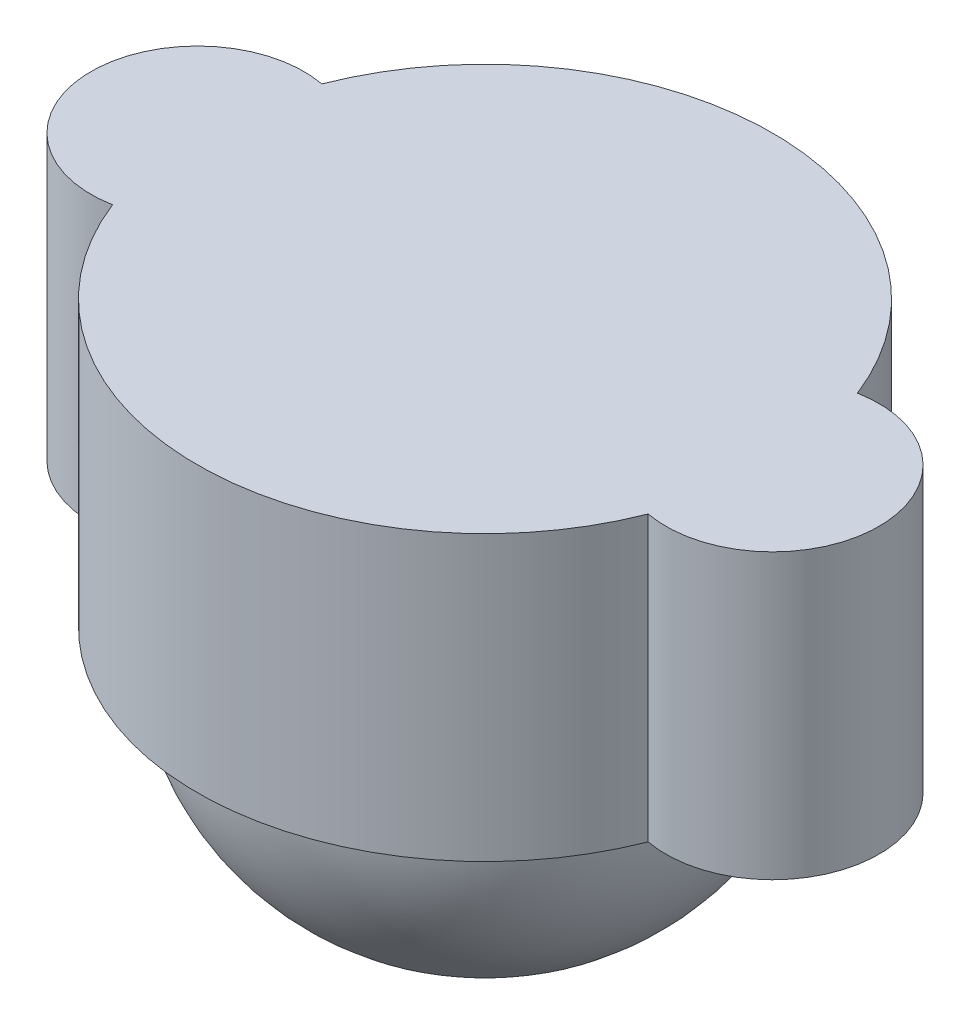
ISO-10303-21;
HEADER;
FILE_DESCRIPTION(('STEP AP214'),'2;1');
FILE_NAME('part.step','',(''),(''),'','','');
FILE_SCHEMA(('AUTOMOTIVE_DESIGN { 1 0 10303 214 1 1 1 1 }'));
ENDSEC;
DATA;
#1=APPLICATION_CONTEXT('core data for automotive mechanical design processes');
#2=APPLICATION_PROTOCOL_DEFINITION('international standard','automotive_design',2000,#1);
#3=PRODUCT_CONTEXT('',#1,'mechanical');
#4=PRODUCT('Part','Part','',(#3));
#5=PRODUCT_RELATED_PRODUCT_CATEGORY('part','',(#4));
#6=PRODUCT_DEFINITION_FORMATION('','',#4);
#7=PRODUCT_DEFINITION_CONTEXT('part definition',#1,'design');
#8=PRODUCT_DEFINITION('design','',#6,#7);
#9=PRODUCT_DEFINITION_SHAPE('','',#8);
#10=(LENGTH_UNIT() NAMED_UNIT(*) SI_UNIT(.MILLI.,.METRE.));
#11=(NAMED_UNIT(*) PLANE_ANGLE_UNIT() SI_UNIT($,.RADIAN.));
#12=(NAMED_UNIT(*) SI_UNIT($,.STERADIAN.) SOLID_ANGLE_UNIT());
#13=UNCERTAINTY_MEASURE_WITH_UNIT(LENGTH_MEASURE(1.E-05),#10,'distance_accuracy_value','');
#14=(GEOMETRIC_REPRESENTATION_CONTEXT(3) GLOBAL_UNCERTAINTY_ASSIGNED_CONTEXT((#13)) GLOBAL_UNIT_ASSIGNED_CONTEXT((#10,
#11,#12)) REPRESENTATION_CONTEXT('',''));
#15=CARTESIAN_POINT('',(0.,0.,0.));
#16=DIRECTION('',(0.,0.,1.));
#17=DIRECTION('',(1.,0.,0.));
#18=AXIS2_PLACEMENT_3D('',#15,#16,#17);
#19=CARTESIAN_POINT('',(0.,-8.,0.));
#20=DIRECTION('',(0.,1.,0.));
#21=DIRECTION('',(0.,0.,1.));
#22=AXIS2_PLACEMENT_3D('',#19,#20,#21);
#23=CYLINDRICAL_SURFACE('',#22,8.1);
#24=CARTESIAN_POINT('',(0.,0.,0.));
#25=DIRECTION('',(0.,1.,0.));
#26=DIRECTION('',(0.,0.,1.));
#27=AXIS2_PLACEMENT_3D('',#24,#25,#26);
#28=CIRCLE('',#27,8.1);
#29=CARTESIAN_POINT('',(7.54444444444444,0.,-2.94811092476036));
#30=VERTEX_POINT('',#29);
#31=CARTESIAN_POINT('',(-7.54444444444444,0.,-2.94811092476036));
#32=VERTEX_POINT('',#31);
#33=EDGE_CURVE('E111',#30,#32,#28,.T.);
#34=ORIENTED_EDGE('',*,*,#33,.F.);
#35=DIRECTION('',(0.,1.,0.));
#36=VECTOR('',#35,1.);
#37=CARTESIAN_POINT('',(7.54444444444444,-8.,-2.94811092476036));
#38=LINE('',#37,#36);
#39=CARTESIAN_POINT('',(7.54444444444444,-8.,-2.94811092476036));
#40=VERTEX_POINT('',#39);
#41=EDGE_CURVE('E11',#40,#30,#38,.T.);
#42=ORIENTED_EDGE('',*,*,#41,.F.);
#43=CARTESIAN_POINT('',(0.,-8.,0.));
#44=DIRECTION('',(0.,1.,0.));
#45=DIRECTION('',(0.,0.,1.));
#46=AXIS2_PLACEMENT_3D('',#43,#44,#45);
#47=CIRCLE('',#46,8.1);
#48=CARTESIAN_POINT('',(-7.54444444444444,-8.,-2.94811092476036));
#49=VERTEX_POINT('',#48);
#50=EDGE_CURVE('E103',#40,#49,#47,.T.);
#51=ORIENTED_EDGE('',*,*,#50,.T.);
#52=DIRECTION('',(0.,1.,0.));
#53=VECTOR('',#52,1.);
#54=CARTESIAN_POINT('',(-7.54444444444444,-8.,-2.94811092476036));
#55=LINE('',#54,#53);
#56=EDGE_CURVE('E83',#49,#32,#55,.T.);
#57=ORIENTED_EDGE('',*,*,#56,.T.);
#58=EDGE_LOOP('',(#34,#42,#51,#57));
#59=FACE_BOUND('',#58,.T.);
#60=ADVANCED_FACE('F39',(#59),#23,.T.);
#61=CARTESIAN_POINT('',(8.1,-8.,0.));
#62=DIRECTION('',(0.,1.,0.));
#63=DIRECTION('',(0.,0.,1.));
#64=AXIS2_PLACEMENT_3D('',#61,#62,#63);
#65=CYLINDRICAL_SURFACE('',#64,3.);
#66=CARTESIAN_POINT('',(8.1,0.,0.));
#67=DIRECTION('',(0.,1.,0.));
#68=DIRECTION('',(0.,0.,1.));
#69=AXIS2_PLACEMENT_3D('',#66,#67,#68);
#70=CIRCLE('',#69,3.);
#71=CARTESIAN_POINT('',(7.54444444444444,0.,2.94811092476036));
#72=VERTEX_POINT('',#71);
#73=EDGE_CURVE('E106',#72,#30,#70,.T.);
#74=ORIENTED_EDGE('',*,*,#73,.F.);
#75=DIRECTION('',(0.,1.,0.));
#76=VECTOR('',#75,1.);
#77=CARTESIAN_POINT('',(7.54444444444444,-8.,2.94811092476036));
#78=LINE('',#77,#76);
#79=CARTESIAN_POINT('',(7.54444444444444,-8.,2.94811092476036));
#80=VERTEX_POINT('',#79);
#81=EDGE_CURVE('E49',#80,#72,#78,.T.);
#82=ORIENTED_EDGE('',*,*,#81,.F.);
#83=CARTESIAN_POINT('',(8.1,-8.,0.));
#84=DIRECTION('',(0.,1.,0.));
#85=DIRECTION('',(0.,0.,1.));
#86=AXIS2_PLACEMENT_3D('',#83,#84,#85);
#87=CIRCLE('',#86,3.);
#88=EDGE_CURVE('E98',#80,#40,#87,.T.);
#89=ORIENTED_EDGE('',*,*,#88,.T.);
#90=ORIENTED_EDGE('',*,*,#41,.T.);
#91=EDGE_LOOP('',(#74,#82,#89,#90));
#92=FACE_BOUND('',#91,.T.);
#93=ADVANCED_FACE('F127',(#92),#65,.T.);
#94=CARTESIAN_POINT('',(0.,-8.,0.));
#95=DIRECTION('',(0.,1.,0.));
#96=DIRECTION('',(0.,0.,1.));
#97=AXIS2_PLACEMENT_3D('',#94,#95,#96);
#98=CYLINDRICAL_SURFACE('',#97,8.1);
#99=CARTESIAN_POINT('',(0.,0.,0.));
#100=DIRECTION('',(0.,1.,0.));
#101=DIRECTION('',(0.,0.,1.));
#102=AXIS2_PLACEMENT_3D('',#99,#100,#101);
#103=CIRCLE('',#102,8.1);
#104=CARTESIAN_POINT('',(-7.54444444444445,0.,2.94811092476035));
#105=VERTEX_POINT('',#104);
#106=EDGE_CURVE('E91',#105,#72,#103,.T.);
#107=ORIENTED_EDGE('',*,*,#106,.F.);
#108=DIRECTION('',(0.,1.,0.));
#109=VECTOR('',#108,1.);
#110=CARTESIAN_POINT('',(-7.54444444444445,-8.,2.94811092476035));
#111=LINE('',#110,#109);
#112=CARTESIAN_POINT('',(-7.54444444444445,-8.,2.94811092476035));
#113=VERTEX_POINT('',#112);
#114=EDGE_CURVE('E86',#113,#105,#111,.T.);
#115=ORIENTED_EDGE('',*,*,#114,.F.);
#116=CARTESIAN_POINT('',(0.,-8.,0.));
#117=DIRECTION('',(0.,1.,0.));
#118=DIRECTION('',(0.,0.,1.));
#119=AXIS2_PLACEMENT_3D('',#116,#117,#118);
#120=CIRCLE('',#119,8.1);
#121=EDGE_CURVE('E89',#113,#80,#120,.T.);
#122=ORIENTED_EDGE('',*,*,#121,.T.);
#123=ORIENTED_EDGE('',*,*,#81,.T.);
#124=EDGE_LOOP('',(#107,#115,#122,#123));
#125=FACE_BOUND('',#124,.T.);
#126=ADVANCED_FACE('F88',(#125),#98,.T.);
#127=CARTESIAN_POINT('',(-8.1,-8.,0.));
#128=DIRECTION('',(0.,1.,0.));
#129=DIRECTION('',(0.,0.,1.));
#130=AXIS2_PLACEMENT_3D('',#127,#128,#129);
#131=CYLINDRICAL_SURFACE('',#130,3.);
#132=CARTESIAN_POINT('',(-8.1,0.,0.));
#133=DIRECTION('',(0.,1.,0.));
#134=DIRECTION('',(0.,0.,1.));
#135=AXIS2_PLACEMENT_3D('',#132,#133,#134);
#136=CIRCLE('',#135,3.);
#137=EDGE_CURVE('E115',#32,#105,#136,.T.);
#138=ORIENTED_EDGE('',*,*,#137,.F.);
#139=ORIENTED_EDGE('',*,*,#56,.F.);
#140=CARTESIAN_POINT('',(-8.1,-8.,0.));
#141=DIRECTION('',(0.,1.,0.));
#142=DIRECTION('',(0.,0.,1.));
#143=AXIS2_PLACEMENT_3D('',#140,#141,#142);
#144=CIRCLE('',#143,3.);
#145=EDGE_CURVE('E97',#49,#113,#144,.T.);
#146=ORIENTED_EDGE('',*,*,#145,.T.);
#147=ORIENTED_EDGE('',*,*,#114,.T.);
#148=EDGE_LOOP('',(#138,#139,#146,#147));
#149=FACE_BOUND('',#148,.T.);
#150=ADVANCED_FACE('F101',(#149),#131,.T.);
#151=CARTESIAN_POINT('',(-4.05,-8.,0.));
#152=DIRECTION('',(0.,1.,0.));
#153=DIRECTION('',(0.,0.,1.));
#154=AXIS2_PLACEMENT_3D('',#151,#152,#153);
#155=PLANE('',#154);
#156=CARTESIAN_POINT('',(0.,-8.,0.));
#157=DIRECTION('',(0.,1.,0.));
#158=DIRECTION('',(0.,0.,1.));
#159=AXIS2_PLACEMENT_3D('',#156,#157,#158);
#160=CIRCLE('',#159,7.);
#161=CARTESIAN_POINT('',(0.,-8.,7.));
#162=VERTEX_POINT('',#161);
#163=EDGE_CURVE('E42',#162,#162,#160,.T.);
#164=ORIENTED_EDGE('',*,*,#163,.T.);
#165=EDGE_LOOP('',(#164));
#166=FACE_BOUND('',#165,.T.);
#167=ORIENTED_EDGE('',*,*,#50,.F.);
#168=ORIENTED_EDGE('',*,*,#88,.F.);
#169=ORIENTED_EDGE('',*,*,#121,.F.);
#170=ORIENTED_EDGE('',*,*,#145,.F.);
#171=EDGE_LOOP('',(#167,#168,#169,#170));
#172=FACE_BOUND('',#171,.T.);
#173=ADVANCED_FACE('F96',(#166,#172),#155,.F.);
#174=CARTESIAN_POINT('',(-4.05,0.,0.));
#175=DIRECTION('',(0.,1.,0.));
#176=DIRECTION('',(0.,0.,1.));
#177=AXIS2_PLACEMENT_3D('',#174,#175,#176);
#178=PLANE('',#177);
#179=ORIENTED_EDGE('',*,*,#33,.T.);
#180=ORIENTED_EDGE('',*,*,#137,.T.);
#181=ORIENTED_EDGE('',*,*,#106,.T.);
#182=ORIENTED_EDGE('',*,*,#73,.T.);
#183=EDGE_LOOP('',(#179,#180,#181,#182));
#184=FACE_BOUND('',#183,.T.);
#185=ADVANCED_FACE('F126',(#184),#178,.T.);
#186=CARTESIAN_POINT('',(0.,-8.,0.));
#187=DIRECTION('',(0.,0.,1.));
#188=DIRECTION('',(1.,0.,0.));
#189=AXIS2_PLACEMENT_3D('',#186,#187,#188);
#190=SPHERICAL_SURFACE('',#189,7.);
#191=CARTESIAN_POINT('',(0.,-8.,0.));
#192=DIRECTION('',(0.,1.,0.));
#193=DIRECTION('',(0.,0.,1.));
#194=AXIS2_PLACEMENT_3D('',#191,#192,#193);
#195=SPHERICAL_SURFACE('',#194,7.);
#196=ORIENTED_EDGE('',*,*,#163,.F.);
#197=EDGE_LOOP('',(#196));
#198=FACE_BOUND('',#197,.T.);
#199=ADVANCED_FACE('F145',(#198),#195,.T.);
#200=CLOSED_SHELL('',(#60,#93,#126,#150,#173,#185,#199));
#201=MANIFOLD_SOLID_BREP('B2',#200);
#202=ADVANCED_BREP_SHAPE_REPRESENTATION('',(#18,#201),#14);
#203=SHAPE_DEFINITION_REPRESENTATION(#9,#202);
ENDSEC;
END-ISO-10303-21;
